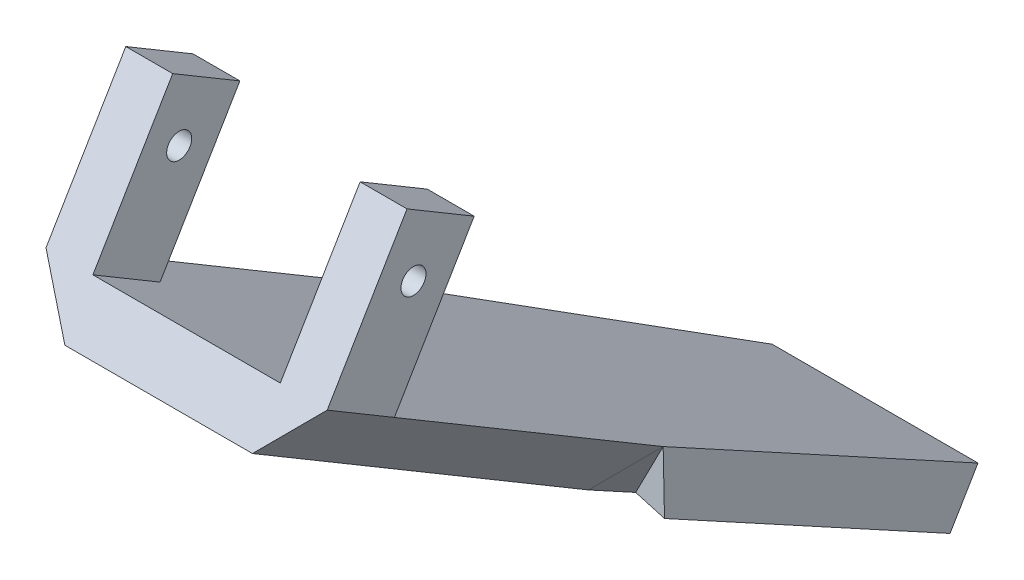
ISO-10303-21;
HEADER;
FILE_DESCRIPTION(('STEP AP214'),'2;1');
FILE_NAME('part.step','',(''),(''),'','','');
FILE_SCHEMA(('AUTOMOTIVE_DESIGN { 1 0 10303 214 1 1 1 1 }'));
ENDSEC;
DATA;
#1=APPLICATION_CONTEXT('core data for automotive mechanical design processes');
#2=APPLICATION_PROTOCOL_DEFINITION('international standard','automotive_design',2000,#1);
#3=PRODUCT_CONTEXT('',#1,'mechanical');
#4=PRODUCT('Part','Part','',(#3));
#5=PRODUCT_RELATED_PRODUCT_CATEGORY('part','',(#4));
#6=PRODUCT_DEFINITION_FORMATION('','',#4);
#7=PRODUCT_DEFINITION_CONTEXT('part definition',#1,'design');
#8=PRODUCT_DEFINITION('design','',#6,#7);
#9=PRODUCT_DEFINITION_SHAPE('','',#8);
#10=(LENGTH_UNIT() NAMED_UNIT(*) SI_UNIT(.MILLI.,.METRE.));
#11=(NAMED_UNIT(*) PLANE_ANGLE_UNIT() SI_UNIT($,.RADIAN.));
#12=(NAMED_UNIT(*) SI_UNIT($,.STERADIAN.) SOLID_ANGLE_UNIT());
#13=UNCERTAINTY_MEASURE_WITH_UNIT(LENGTH_MEASURE(1.E-05),#10,'distance_accuracy_value','');
#14=(GEOMETRIC_REPRESENTATION_CONTEXT(3) GLOBAL_UNCERTAINTY_ASSIGNED_CONTEXT((#13)) GLOBAL_UNIT_ASSIGNED_CONTEXT((#10,
#11,#12)) REPRESENTATION_CONTEXT('',''));
#15=CARTESIAN_POINT('',(0.,0.,0.));
#16=DIRECTION('',(0.,0.,1.));
#17=DIRECTION('',(1.,0.,0.));
#18=AXIS2_PLACEMENT_3D('',#15,#16,#17);
#19=CARTESIAN_POINT('',(3.15077540342877E-13,107.565160262146,-63.8830981525143));
#20=DIRECTION('',(0.,0.859797597686012,-0.510634988042694));
#21=DIRECTION('',(0.,0.510634988042694,0.859797597686012));
#22=AXIS2_PLACEMENT_3D('',#19,#20,#21);
#23=PLANE('',#22);
#24=DIRECTION('',(1.,0.,0.));
#25=VECTOR('',#24,1.);
#26=CARTESIAN_POINT('',(-22.8498957354244,169.178242790574,39.8598524569394));
#27=LINE('',#26,#25);
#28=CARTESIAN_POINT('',(-22.8498957354244,169.178242790574,39.8598524569394));
#29=VERTEX_POINT('',#28);
#30=CARTESIAN_POINT('',(-15.2298957354244,169.178242790574,39.8598524569394));
#31=VERTEX_POINT('',#30);
#32=EDGE_CURVE('E175',#29,#31,#27,.T.);
#33=ORIENTED_EDGE('',*,*,#32,.T.);
#34=DIRECTION('',(0.,-0.510634988042694,-0.859797597686012));
#35=VECTOR('',#34,1.);
#36=CARTESIAN_POINT('',(-15.2298957354245,175.663307138716,50.7792819475518));
#37=LINE('',#36,#35);
#38=CARTESIAN_POINT('',(-15.2298957354245,175.663307138716,50.7792819475518));
#39=VERTEX_POINT('',#38);
#40=EDGE_CURVE('E164',#39,#31,#37,.T.);
#41=ORIENTED_EDGE('',*,*,#40,.F.);
#42=DIRECTION('',(-1.,0.,0.));
#43=VECTOR('',#42,1.);
#44=CARTESIAN_POINT('',(22.8498957354245,175.663307138716,50.7792819475517));
#45=LINE('',#44,#43);
#46=CARTESIAN_POINT('',(15.2298957354244,175.663307138716,50.7792819475517));
#47=VERTEX_POINT('',#46);
#48=EDGE_CURVE('E202',#47,#39,#45,.T.);
#49=ORIENTED_EDGE('',*,*,#48,.F.);
#50=DIRECTION('',(0.,-0.510634988042694,-0.859797597686012));
#51=VECTOR('',#50,1.);
#52=CARTESIAN_POINT('',(15.2298957354245,175.663307138716,50.7792819475518));
#53=LINE('',#52,#51);
#54=CARTESIAN_POINT('',(15.2298957354244,169.178242790574,39.8598524569394));
#55=VERTEX_POINT('',#54);
#56=EDGE_CURVE('E50',#47,#55,#53,.T.);
#57=ORIENTED_EDGE('',*,*,#56,.T.);
#58=DIRECTION('',(-1.,0.,0.));
#59=VECTOR('',#58,1.);
#60=CARTESIAN_POINT('',(22.8498957354244,169.178242790574,39.8598524569394));
#61=LINE('',#60,#59);
#62=CARTESIAN_POINT('',(22.8498957354244,169.178242790574,39.8598524569394));
#63=VERTEX_POINT('',#62);
#64=EDGE_CURVE('E189',#63,#55,#61,.T.);
#65=ORIENTED_EDGE('',*,*,#64,.F.);
#66=DIRECTION('',(0.,-0.510634988042694,-0.859797597686012));
#67=VECTOR('',#66,1.);
#68=CARTESIAN_POINT('',(22.8498957354245,175.663307138716,50.7792819475517));
#69=LINE('',#68,#67);
#70=CARTESIAN_POINT('',(22.8498957354242,143.237985398005,-3.81786550551013));
#71=VERTEX_POINT('',#70);
#72=EDGE_CURVE('E216',#63,#71,#69,.T.);
#73=ORIENTED_EDGE('',*,*,#72,.T.);
#74=DIRECTION('',(0.0915092330061505,0.508492479999174,0.856190082901523));
#75=VECTOR('',#74,1.);
#76=CARTESIAN_POINT('',(22.8498957354257,143.237985398005,-3.81786550551011));
#77=LINE('',#76,#75);
#78=CARTESIAN_POINT('',(16.726681449711,109.212911474588,-61.1086456233753));
#79=VERTEX_POINT('',#78);
#80=EDGE_CURVE('E260',#79,#71,#77,.T.);
#81=ORIENTED_EDGE('',*,*,#80,.F.);
#82=DIRECTION('',(1.,0.,0.));
#83=VECTOR('',#82,1.);
#84=CARTESIAN_POINT('',(16.726681449711,109.212911474588,-61.1086456233753));
#85=LINE('',#84,#83);
#86=CARTESIAN_POINT('',(-16.7266814497103,109.212911474588,-61.1086456233752));
#87=VERTEX_POINT('',#86);
#88=EDGE_CURVE('E248',#87,#79,#85,.T.);
#89=ORIENTED_EDGE('',*,*,#88,.F.);
#90=DIRECTION('',(0.0915092330061379,-0.508492479999174,-0.856190082901523));
#91=VECTOR('',#90,1.);
#92=CARTESIAN_POINT('',(-16.7266814497103,109.212911474588,-61.1086456233752));
#93=LINE('',#92,#91);
#94=CARTESIAN_POINT('',(-22.8498957354242,143.237985398005,-3.81786550550991));
#95=VERTEX_POINT('',#94);
#96=EDGE_CURVE('E253',#95,#87,#93,.T.);
#97=ORIENTED_EDGE('',*,*,#96,.F.);
#98=DIRECTION('',(0.,-0.510634988042694,-0.859797597686012));
#99=VECTOR('',#98,1.);
#100=CARTESIAN_POINT('',(-22.8498957354238,175.663307138716,50.7792819475519));
#101=LINE('',#100,#99);
#102=EDGE_CURVE('E223',#29,#95,#101,.T.);
#103=ORIENTED_EDGE('',*,*,#102,.F.);
#104=EDGE_LOOP('',(#33,#41,#49,#57,#65,#73,#81,#89,#97,#103));
#105=FACE_BOUND('',#104,.T.);
#106=ADVANCED_FACE('F35',(#105),#23,.T.);
#107=CARTESIAN_POINT('',(-16.7266814497103,101.56931083116,-56.5691005796756));
#108=DIRECTION('',(0.995804227885496,0.0467278161018831,0.0786794187047682));
#109=DIRECTION('',(0.0787654574435743,0.,-0.996893175176611));
#110=AXIS2_PLACEMENT_3D('',#107,#108,#109);
#111=PLANE('',#110);
#112=DIRECTION('',(0.052479328962753,-0.995972651507853,-0.0726938613641871));
#113=VECTOR('',#112,1.);
#114=CARTESIAN_POINT('',(-20.4538526052089,97.7649681797145,-7.13684138750147));
#115=LINE('',#114,#113);
#116=CARTESIAN_POINT('',(-22.2803977258976,132.429835717221,-4.60672866687167));
#117=VERTEX_POINT('',#116);
#118=EDGE_CURVE('E246',#95,#117,#115,.T.);
#119=ORIENTED_EDGE('',*,*,#118,.F.);
#120=ORIENTED_EDGE('',*,*,#96,.T.);
#121=DIRECTION('',(0.,0.859797597686012,-0.510634988042694));
#122=VECTOR('',#121,1.);
#123=CARTESIAN_POINT('',(-16.7266814497103,101.56931083116,-56.5691005796756));
#124=LINE('',#123,#122);
#125=CARTESIAN_POINT('',(-16.7266814497103,101.56931083116,-56.5691005796756));
#126=VERTEX_POINT('',#125);
#127=EDGE_CURVE('E43',#126,#87,#124,.T.);
#128=ORIENTED_EDGE('',*,*,#127,.F.);
#129=DIRECTION('',(0.0915092330061379,-0.508492479999174,-0.856190082901523));
#130=VECTOR('',#129,1.);
#131=CARTESIAN_POINT('',(-16.7266814497103,101.56931083116,-56.5691005796756));
#132=LINE('',#131,#130);
#133=EDGE_CURVE('E256',#117,#126,#132,.T.);
#134=ORIENTED_EDGE('',*,*,#133,.F.);
#135=EDGE_LOOP('',(#119,#120,#128,#134));
#136=FACE_BOUND('',#135,.T.);
#137=ADVANCED_FACE('F284',(#136),#111,.F.);
#138=CARTESIAN_POINT('',(2.92136663140291E-13,99.9215596187176,-59.3435531088147));
#139=DIRECTION('',(0.,0.859797597686012,-0.510634988042694));
#140=DIRECTION('',(0.,0.510634988042694,0.859797597686012));
#141=AXIS2_PLACEMENT_3D('',#138,#139,#140);
#142=PLANE('',#141);
#143=DIRECTION('',(0.0915092330061505,0.508492479999174,0.856190082901523));
#144=VECTOR('',#143,1.);
#145=CARTESIAN_POINT('',(22.8498957354256,135.594384754576,0.721679538189439));
#146=LINE('',#145,#144);
#147=CARTESIAN_POINT('',(16.7266814497109,101.56931083116,-56.5691005796757));
#148=VERTEX_POINT('',#147);
#149=CARTESIAN_POINT('',(22.2803977258991,132.429835717221,-4.60672866687108));
#150=VERTEX_POINT('',#149);
#151=EDGE_CURVE('E252',#148,#150,#146,.T.);
#152=ORIENTED_EDGE('',*,*,#151,.T.);
#153=DIRECTION('',(-0.902018907578412,-0.220439350280052,-0.371171635795567));
#154=VECTOR('',#153,1.);
#155=CARTESIAN_POINT('',(-20.6378422511927,121.941287355067,-22.2671493120769));
#156=LINE('',#155,#154);
#157=CARTESIAN_POINT('',(14.320423419229,130.484542165538,-7.88217739579986));
#158=VERTEX_POINT('',#157);
#159=EDGE_CURVE('E58',#150,#158,#156,.T.);
#160=ORIENTED_EDGE('',*,*,#159,.T.);
#161=DIRECTION('',(-0.0915092330061375,-0.508492479999174,-0.856190082901524));
#162=VECTOR('',#161,1.);
#163=CARTESIAN_POINT('',(8.74639313406406,99.5111377320872,-60.0346137694154));
#164=LINE('',#163,#162);
#165=CARTESIAN_POINT('',(15.2399999999991,135.594384754576,0.721679538189475));
#166=VERTEX_POINT('',#165);
#167=EDGE_CURVE('E227',#166,#158,#164,.T.);
#168=ORIENTED_EDGE('',*,*,#167,.F.);
#169=DIRECTION('',(0.,-0.510634988042694,-0.859797597686012));
#170=VECTOR('',#169,1.);
#171=CARTESIAN_POINT('',(15.2399999999995,168.019706495288,55.3188269912513));
#172=LINE('',#171,#170);
#173=CARTESIAN_POINT('',(15.2399999999995,168.019706495288,55.3188269912513));
#174=VERTEX_POINT('',#173);
#175=EDGE_CURVE('E219',#174,#166,#172,.T.);
#176=ORIENTED_EDGE('',*,*,#175,.F.);
#177=DIRECTION('',(1.,0.,0.));
#178=VECTOR('',#177,1.);
#179=CARTESIAN_POINT('',(-15.2399999999988,168.019706495288,55.3188269912514));
#180=LINE('',#179,#178);
#181=CARTESIAN_POINT('',(-15.2399999999988,168.019706495288,55.3188269912514));
#182=VERTEX_POINT('',#181);
#183=EDGE_CURVE('E212',#182,#174,#180,.T.);
#184=ORIENTED_EDGE('',*,*,#183,.F.);
#185=DIRECTION('',(0.,-0.510634988042694,-0.859797597686012));
#186=VECTOR('',#185,1.);
#187=CARTESIAN_POINT('',(-15.2399999999988,168.019706495288,55.3188269912514));
#188=LINE('',#187,#186);
#189=CARTESIAN_POINT('',(-15.2399999999992,135.594384754577,0.721679538189614));
#190=VERTEX_POINT('',#189);
#191=EDGE_CURVE('E221',#182,#190,#188,.T.);
#192=ORIENTED_EDGE('',*,*,#191,.T.);
#193=DIRECTION('',(-0.0915092330061378,0.508492479999174,0.856190082901523));
#194=VECTOR('',#193,1.);
#195=CARTESIAN_POINT('',(-8.7463931340641,99.5111377320872,-60.0346137694155));
#196=LINE('',#195,#194);
#197=CARTESIAN_POINT('',(-14.320423419229,130.484542165538,-7.88217739579983));
#198=VERTEX_POINT('',#197);
#199=EDGE_CURVE('E237',#198,#190,#196,.T.);
#200=ORIENTED_EDGE('',*,*,#199,.F.);
#201=DIRECTION('',(0.902018907578411,-0.220439350280057,-0.371171635795566));
#202=VECTOR('',#201,1.);
#203=CARTESIAN_POINT('',(20.6378422511932,121.941287355067,-22.2671493120772));
#204=LINE('',#203,#202);
#205=EDGE_CURVE('E243',#117,#198,#204,.T.);
#206=ORIENTED_EDGE('',*,*,#205,.F.);
#207=ORIENTED_EDGE('',*,*,#133,.T.);
#208=DIRECTION('',(1.,0.,0.));
#209=VECTOR('',#208,1.);
#210=CARTESIAN_POINT('',(16.7266814497109,101.56931083116,-56.5691005796757));
#211=LINE('',#210,#209);
#212=EDGE_CURVE('E249',#126,#148,#211,.T.);
#213=ORIENTED_EDGE('',*,*,#212,.T.);
#214=EDGE_LOOP('',(#152,#160,#168,#176,#184,#192,#200,#206,#207,#213));
#215=FACE_BOUND('',#214,.T.);
#216=ADVANCED_FACE('F280',(#215),#142,.F.);
#217=CARTESIAN_POINT('',(16.7266814497109,101.56931083116,-56.5691005796757));
#218=DIRECTION('',(0.,0.510634988042694,0.859797597686012));
#219=DIRECTION('',(0.,-0.859797597686012,0.510634988042694));
#220=AXIS2_PLACEMENT_3D('',#217,#218,#219);
#221=PLANE('',#220);
#222=ORIENTED_EDGE('',*,*,#88,.T.);
#223=DIRECTION('',(0.,0.859797597686012,-0.510634988042694));
#224=VECTOR('',#223,1.);
#225=CARTESIAN_POINT('',(16.7266814497109,101.56931083116,-56.5691005796757));
#226=LINE('',#225,#224);
#227=EDGE_CURVE('E11',#148,#79,#226,.T.);
#228=ORIENTED_EDGE('',*,*,#227,.F.);
#229=ORIENTED_EDGE('',*,*,#212,.F.);
#230=ORIENTED_EDGE('',*,*,#127,.T.);
#231=EDGE_LOOP('',(#222,#228,#229,#230));
#232=FACE_BOUND('',#231,.T.);
#233=ADVANCED_FACE('F37',(#232),#221,.F.);
#234=CARTESIAN_POINT('',(22.8498957354256,135.594384754576,0.721679538189439));
#235=DIRECTION('',(-0.995804227885495,0.046727816101894,0.0786794187047764));
#236=DIRECTION('',(0.0787654574435826,0.,0.99689317517661));
#237=AXIS2_PLACEMENT_3D('',#234,#235,#236);
#238=PLANE('',#237);
#239=ORIENTED_EDGE('',*,*,#80,.T.);
#240=DIRECTION('',(-0.0524793289627648,-0.995972651507852,-0.0726938613641918));
#241=VECTOR('',#240,1.);
#242=CARTESIAN_POINT('',(22.4676982214255,135.984495710882,-4.34728182324054));
#243=LINE('',#242,#241);
#244=EDGE_CURVE('E232',#71,#150,#243,.T.);
#245=ORIENTED_EDGE('',*,*,#244,.T.);
#246=ORIENTED_EDGE('',*,*,#151,.F.);
#247=ORIENTED_EDGE('',*,*,#227,.T.);
#248=EDGE_LOOP('',(#239,#245,#246,#247));
#249=FACE_BOUND('',#248,.T.);
#250=ADVANCED_FACE('F278',(#249),#238,.F.);
#251=CARTESIAN_POINT('',(-30.5495363149618,137.209807160721,-1.06065639384045));
#252=DIRECTION('',(0.369989021228379,-0.0482216174266743,0.927783810908135));
#253=DIRECTION('',(0.928864394965883,0.,-0.370419945149642));
#254=AXIS2_PLACEMENT_3D('',#251,#252,#253);
#255=PLANE('',#254);
#256=ORIENTED_EDGE('',*,*,#118,.T.);
#257=ORIENTED_EDGE('',*,*,#205,.T.);
#258=DIRECTION('',(0.537390658944143,-0.80351761614714,-0.256067803951994));
#259=VECTOR('',#258,1.);
#260=CARTESIAN_POINT('',(-22.8498957354242,143.237985398005,-3.81786550550993));
#261=LINE('',#260,#259);
#262=EDGE_CURVE('E235',#95,#198,#261,.T.);
#263=ORIENTED_EDGE('',*,*,#262,.F.);
#264=EDGE_LOOP('',(#256,#257,#263));
#265=FACE_BOUND('',#264,.T.);
#266=ADVANCED_FACE('F287',(#265),#255,.T.);
#267=CARTESIAN_POINT('',(52.0681969952759,40.7650680235233,-18.6454037302863));
#268=DIRECTION('',(-0.757838639718275,-0.59332462965393,0.271378849573768));
#269=DIRECTION('',(0.61645871798258,-0.787387229400677,0.));
#270=AXIS2_PLACEMENT_3D('',#267,#268,#269);
#271=PLANE('',#270);
#272=DIRECTION('',(-0.65029348212864,0.653173690051668,-0.387920762173535));
#273=VECTOR('',#272,1.);
#274=CARTESIAN_POINT('',(-18.4580849825889,138.826722923025,-1.19801059171771));
#275=LINE('',#274,#273);
#276=EDGE_CURVE('E240',#190,#95,#275,.T.);
#277=ORIENTED_EDGE('',*,*,#276,.T.);
#278=ORIENTED_EDGE('',*,*,#262,.T.);
#279=ORIENTED_EDGE('',*,*,#199,.T.);
#280=EDGE_LOOP('',(#277,#278,#279));
#281=FACE_BOUND('',#280,.T.);
#282=ADVANCED_FACE('F289',(#281),#271,.T.);
#283=CARTESIAN_POINT('',(30.5495363149618,137.209807160721,-1.06065639384045));
#284=DIRECTION('',(0.369989021228379,0.0482216174266743,-0.927783810908135));
#285=DIRECTION('',(-0.928864394965883,0.,-0.370419945149642));
#286=AXIS2_PLACEMENT_3D('',#283,#284,#285);
#287=PLANE('',#286);
#288=ORIENTED_EDGE('',*,*,#244,.F.);
#289=DIRECTION('',(-0.537390658944143,-0.80351761614714,-0.256067803951993));
#290=VECTOR('',#289,1.);
#291=CARTESIAN_POINT('',(22.8498957354242,143.237985398005,-3.81786550550993));
#292=LINE('',#291,#290);
#293=EDGE_CURVE('E225',#71,#158,#292,.T.);
#294=ORIENTED_EDGE('',*,*,#293,.T.);
#295=ORIENTED_EDGE('',*,*,#159,.F.);
#296=EDGE_LOOP('',(#288,#294,#295));
#297=FACE_BOUND('',#296,.T.);
#298=ADVANCED_FACE('F444',(#297),#287,.F.);
#299=CARTESIAN_POINT('',(-52.0681969952759,40.7650680235233,-18.6454037302863));
#300=DIRECTION('',(0.757838639718275,-0.59332462965393,0.271378849573768));
#301=DIRECTION('',(-0.61645871798258,-0.787387229400677,0.));
#302=AXIS2_PLACEMENT_3D('',#299,#300,#301);
#303=PLANE('',#302);
#304=DIRECTION('',(-0.65029348212864,-0.653173690051664,0.387920762173541));
#305=VECTOR('',#304,1.);
#306=CARTESIAN_POINT('',(-0.867516543751043,119.41552658117,10.3303258895586));
#307=LINE('',#306,#305);
#308=EDGE_CURVE('E229',#71,#166,#307,.T.);
#309=ORIENTED_EDGE('',*,*,#308,.T.);
#310=ORIENTED_EDGE('',*,*,#167,.T.);
#311=ORIENTED_EDGE('',*,*,#293,.F.);
#312=EDGE_LOOP('',(#309,#310,#311));
#313=FACE_BOUND('',#312,.T.);
#314=ADVANCED_FACE('F360',(#313),#303,.T.);
#315=CARTESIAN_POINT('',(-22.8498957354238,175.663307138716,50.7792819475519));
#316=DIRECTION('',(0.759683083332128,0.559120773725074,-0.332062604471003));
#317=DIRECTION('',(-0.592755279599119,0.805382628635216,0.));
#318=AXIS2_PLACEMENT_3D('',#315,#316,#317);
#319=PLANE('',#318);
#320=ORIENTED_EDGE('',*,*,#276,.F.);
#321=ORIENTED_EDGE('',*,*,#191,.F.);
#322=DIRECTION('',(0.65029348212864,-0.653173690051668,0.387920762173534));
#323=VECTOR('',#322,1.);
#324=CARTESIAN_POINT('',(-22.8498957354238,175.663307138716,50.7792819475519));
#325=LINE('',#324,#323);
#326=CARTESIAN_POINT('',(-22.8498957354238,175.663307138716,50.7792819475519));
#327=VERTEX_POINT('',#326);
#328=EDGE_CURVE('E210',#327,#182,#325,.T.);
#329=ORIENTED_EDGE('',*,*,#328,.F.);
#330=EDGE_CURVE('E150',#327,#29,#101,.T.);
#331=ORIENTED_EDGE('',*,*,#330,.T.);
#332=ORIENTED_EDGE('',*,*,#102,.T.);
#333=EDGE_LOOP('',(#320,#321,#329,#331,#332));
#334=FACE_BOUND('',#333,.T.);
#335=ADVANCED_FACE('F293',(#334),#319,.F.);
#336=CARTESIAN_POINT('',(15.2399999999995,168.019706495288,55.3188269912513));
#337=DIRECTION('',(-0.759683083332125,0.559120773725081,-0.332062604470998));
#338=DIRECTION('',(-0.592755279599125,-0.805382628635211,0.));
#339=AXIS2_PLACEMENT_3D('',#336,#337,#338);
#340=PLANE('',#339);
#341=ORIENTED_EDGE('',*,*,#308,.F.);
#342=ORIENTED_EDGE('',*,*,#72,.F.);
#343=CARTESIAN_POINT('',(22.8498957354245,175.663307138716,50.7792819475517));
#344=VERTEX_POINT('',#343);
#345=EDGE_CURVE('E217',#344,#63,#69,.T.);
#346=ORIENTED_EDGE('',*,*,#345,.F.);
#347=DIRECTION('',(0.650293482128643,0.653173690051662,-0.387920762173539));
#348=VECTOR('',#347,1.);
#349=CARTESIAN_POINT('',(15.2399999999995,168.019706495288,55.3188269912513));
#350=LINE('',#349,#348);
#351=EDGE_CURVE('E214',#174,#344,#350,.T.);
#352=ORIENTED_EDGE('',*,*,#351,.F.);
#353=ORIENTED_EDGE('',*,*,#175,.T.);
#354=EDGE_LOOP('',(#341,#342,#346,#352,#353));
#355=FACE_BOUND('',#354,.T.);
#356=ADVANCED_FACE('F370',(#355),#340,.F.);
#357=CARTESIAN_POINT('',(7.8663034480051E-13,68.0981468765698,114.662380100066));
#358=DIRECTION('',(0.,0.510634988042693,0.859797597686013));
#359=DIRECTION('',(0.,-0.859797597686013,0.510634988042693));
#360=AXIS2_PLACEMENT_3D('',#357,#358,#359);
#361=PLANE('',#360);
#362=ORIENTED_EDGE('',*,*,#351,.T.);
#363=DIRECTION('',(0.,-0.859797597686012,0.510634988042694));
#364=VECTOR('',#363,1.);
#365=CARTESIAN_POINT('',(22.8498957354246,197.502166119941,37.8091532512673));
#366=LINE('',#365,#364);
#367=CARTESIAN_POINT('',(22.8498957354246,197.502166119941,37.8091532512673));
#368=VERTEX_POINT('',#367);
#369=EDGE_CURVE('E200',#368,#344,#366,.T.);
#370=ORIENTED_EDGE('',*,*,#369,.F.);
#371=DIRECTION('',(-1.,0.,0.));
#372=VECTOR('',#371,1.);
#373=CARTESIAN_POINT('',(22.8498957354246,197.502166119941,37.8091532512673));
#374=LINE('',#373,#372);
#375=CARTESIAN_POINT('',(15.2298957354246,197.502166119941,37.8091532512673));
#376=VERTEX_POINT('',#375);
#377=EDGE_CURVE('E185',#368,#376,#374,.T.);
#378=ORIENTED_EDGE('',*,*,#377,.T.);
#379=DIRECTION('',(0.,-0.859797597686012,0.510634988042694));
#380=VECTOR('',#379,1.);
#381=CARTESIAN_POINT('',(15.2298957354246,197.502166119941,37.8091532512673));
#382=LINE('',#381,#380);
#383=EDGE_CURVE('E196',#376,#47,#382,.T.);
#384=ORIENTED_EDGE('',*,*,#383,.T.);
#385=ORIENTED_EDGE('',*,*,#48,.T.);
#386=DIRECTION('',(0.,-0.859797597686012,0.510634988042694));
#387=VECTOR('',#386,1.);
#388=CARTESIAN_POINT('',(-15.2298957354246,197.502166119941,37.8091532512673));
#389=LINE('',#388,#387);
#390=CARTESIAN_POINT('',(-15.2298957354246,197.502166119941,37.8091532512673));
#391=VERTEX_POINT('',#390);
#392=EDGE_CURVE('E162',#391,#39,#389,.T.);
#393=ORIENTED_EDGE('',*,*,#392,.F.);
#394=DIRECTION('',(1.,0.,0.));
#395=VECTOR('',#394,1.);
#396=CARTESIAN_POINT('',(-22.8498957354246,197.502166119941,37.8091532512673));
#397=LINE('',#396,#395);
#398=CARTESIAN_POINT('',(-22.8498957354246,197.502166119941,37.8091532512673));
#399=VERTEX_POINT('',#398);
#400=EDGE_CURVE('E158',#399,#391,#397,.T.);
#401=ORIENTED_EDGE('',*,*,#400,.F.);
#402=DIRECTION('',(0.,-0.859797597686012,0.510634988042694));
#403=VECTOR('',#402,1.);
#404=CARTESIAN_POINT('',(-22.8498957354246,197.502166119941,37.8091532512673));
#405=LINE('',#404,#403);
#406=EDGE_CURVE('E144',#399,#327,#405,.T.);
#407=ORIENTED_EDGE('',*,*,#406,.T.);
#408=ORIENTED_EDGE('',*,*,#328,.T.);
#409=ORIENTED_EDGE('',*,*,#183,.T.);
#410=EDGE_LOOP('',(#362,#370,#378,#384,#385,#393,#401,#407,#408,#409));
#411=FACE_BOUND('',#410,.T.);
#412=ADVANCED_FACE('F160',(#411),#361,.T.);
#413=CARTESIAN_POINT('',(22.8498957354246,197.502166119941,37.8091532512673));
#414=DIRECTION('',(-1.,0.,0.));
#415=DIRECTION('',(0.,-1.,0.));
#416=AXIS2_PLACEMENT_3D('',#413,#414,#415);
#417=PLANE('',#416);
#418=CARTESIAN_POINT('',(22.8498957354257,186.834421892253,36.7592822626979));
#419=DIRECTION('',(-1.,0.,0.));
#420=DIRECTION('',(0.,-1.,0.));
#421=AXIS2_PLACEMENT_3D('',#418,#419,#420);
#422=CIRCLE('',#421,2.03199999668591);
#423=CARTESIAN_POINT('',(22.8498957354257,184.802421895568,36.7592822626979));
#424=VERTEX_POINT('',#423);
#425=EDGE_CURVE('E477',#424,#424,#422,.T.);
#426=ORIENTED_EDGE('',*,*,#425,.T.);
#427=EDGE_LOOP('',(#426));
#428=FACE_BOUND('',#427,.T.);
#429=ORIENTED_EDGE('',*,*,#345,.T.);
#430=DIRECTION('',(0.,-0.859797597686012,0.510634988042694));
#431=VECTOR('',#430,1.);
#432=CARTESIAN_POINT('',(22.8498957354245,191.017101771799,26.8897237606549));
#433=LINE('',#432,#431);
#434=CARTESIAN_POINT('',(22.8498957354245,191.017101771799,26.8897237606549));
#435=VERTEX_POINT('',#434);
#436=EDGE_CURVE('E203',#435,#63,#433,.T.);
#437=ORIENTED_EDGE('',*,*,#436,.F.);
#438=DIRECTION('',(0.,-0.510634988042694,-0.859797597686012));
#439=VECTOR('',#438,1.);
#440=CARTESIAN_POINT('',(22.8498957354246,197.502166119941,37.8091532512673));
#441=LINE('',#440,#439);
#442=EDGE_CURVE('E194',#368,#435,#441,.T.);
#443=ORIENTED_EDGE('',*,*,#442,.F.);
#444=ORIENTED_EDGE('',*,*,#369,.T.);
#445=EDGE_LOOP('',(#429,#437,#443,#444));
#446=FACE_BOUND('',#445,.T.);
#447=ADVANCED_FACE('F387',(#428,#446),#417,.F.);
#448=CARTESIAN_POINT('',(22.8498957354245,191.017101771799,26.8897237606549));
#449=DIRECTION('',(0.,0.510634988042694,0.859797597686012));
#450=DIRECTION('',(0.,-0.859797597686012,0.510634988042694));
#451=AXIS2_PLACEMENT_3D('',#448,#449,#450);
#452=PLANE('',#451);
#453=ORIENTED_EDGE('',*,*,#64,.T.);
#454=DIRECTION('',(0.,-0.859797597686012,0.510634988042694));
#455=VECTOR('',#454,1.);
#456=CARTESIAN_POINT('',(15.2298957354245,191.017101771799,26.889723760655));
#457=LINE('',#456,#455);
#458=CARTESIAN_POINT('',(15.2298957354245,191.017101771799,26.889723760655));
#459=VERTEX_POINT('',#458);
#460=EDGE_CURVE('E206',#459,#55,#457,.T.);
#461=ORIENTED_EDGE('',*,*,#460,.F.);
#462=DIRECTION('',(-1.,0.,0.));
#463=VECTOR('',#462,1.);
#464=CARTESIAN_POINT('',(22.8498957354245,191.017101771799,26.8897237606549));
#465=LINE('',#464,#463);
#466=EDGE_CURVE('E192',#435,#459,#465,.T.);
#467=ORIENTED_EDGE('',*,*,#466,.F.);
#468=ORIENTED_EDGE('',*,*,#436,.T.);
#469=EDGE_LOOP('',(#453,#461,#467,#468));
#470=FACE_BOUND('',#469,.T.);
#471=ADVANCED_FACE('F402',(#470),#452,.F.);
#472=CARTESIAN_POINT('',(15.2298957354246,197.502166119941,37.8091532512673));
#473=DIRECTION('',(-1.,0.,0.));
#474=DIRECTION('',(0.,-1.,0.));
#475=AXIS2_PLACEMENT_3D('',#472,#473,#474);
#476=PLANE('',#475);
#477=CARTESIAN_POINT('',(15.2298957354245,186.834421892253,36.7592822626979));
#478=DIRECTION('',(-1.,0.,0.));
#479=DIRECTION('',(0.,-1.,0.));
#480=AXIS2_PLACEMENT_3D('',#477,#478,#479);
#481=CIRCLE('',#480,2.03199999668591);
#482=CARTESIAN_POINT('',(15.2298957354245,184.802421895568,36.7592822626979));
#483=VERTEX_POINT('',#482);
#484=EDGE_CURVE('E178',#483,#483,#481,.T.);
#485=ORIENTED_EDGE('',*,*,#484,.F.);
#486=EDGE_LOOP('',(#485));
#487=FACE_BOUND('',#486,.T.);
#488=ORIENTED_EDGE('',*,*,#56,.F.);
#489=ORIENTED_EDGE('',*,*,#383,.F.);
#490=DIRECTION('',(0.,-0.510634988042694,-0.859797597686012));
#491=VECTOR('',#490,1.);
#492=CARTESIAN_POINT('',(15.2298957354246,197.502166119941,37.8091532512673));
#493=LINE('',#492,#491);
#494=EDGE_CURVE('E188',#376,#459,#493,.T.);
#495=ORIENTED_EDGE('',*,*,#494,.T.);
#496=ORIENTED_EDGE('',*,*,#460,.T.);
#497=EDGE_LOOP('',(#488,#489,#495,#496));
#498=FACE_BOUND('',#497,.T.);
#499=ADVANCED_FACE('F312',(#487,#498),#476,.T.);
#500=CARTESIAN_POINT('',(3.82190589881541E-13,129.404019243371,-76.8532268487988));
#501=DIRECTION('',(0.,-0.859797597686012,0.510634988042694));
#502=DIRECTION('',(0.,-0.510634988042694,-0.859797597686012));
#503=AXIS2_PLACEMENT_3D('',#500,#501,#502);
#504=PLANE('',#503);
#505=ORIENTED_EDGE('',*,*,#377,.F.);
#506=ORIENTED_EDGE('',*,*,#442,.T.);
#507=ORIENTED_EDGE('',*,*,#466,.T.);
#508=ORIENTED_EDGE('',*,*,#494,.F.);
#509=EDGE_LOOP('',(#505,#506,#507,#508));
#510=FACE_BOUND('',#509,.T.);
#511=ADVANCED_FACE('F304',(#510),#504,.F.);
#512=CARTESIAN_POINT('',(-15.2298957354246,197.502166119941,37.8091532512673));
#513=DIRECTION('',(-1.,0.,0.));
#514=DIRECTION('',(0.,-1.,0.));
#515=AXIS2_PLACEMENT_3D('',#512,#513,#514);
#516=PLANE('',#515);
#517=CARTESIAN_POINT('',(-15.2298957354245,186.834421892253,36.7592822626979));
#518=DIRECTION('',(-1.,0.,0.));
#519=DIRECTION('',(0.,-1.,0.));
#520=AXIS2_PLACEMENT_3D('',#517,#518,#519);
#521=CIRCLE('',#520,2.03199999668591);
#522=CARTESIAN_POINT('',(-15.2298957354245,184.802421895568,36.7592822626979));
#523=VERTEX_POINT('',#522);
#524=EDGE_CURVE('E480',#523,#523,#521,.T.);
#525=ORIENTED_EDGE('',*,*,#524,.T.);
#526=EDGE_LOOP('',(#525));
#527=FACE_BOUND('',#526,.T.);
#528=ORIENTED_EDGE('',*,*,#40,.T.);
#529=DIRECTION('',(0.,-0.859797597686012,0.510634988042694));
#530=VECTOR('',#529,1.);
#531=CARTESIAN_POINT('',(-15.2298957354245,191.017101771799,26.889723760655));
#532=LINE('',#531,#530);
#533=CARTESIAN_POINT('',(-15.2298957354245,191.017101771799,26.889723760655));
#534=VERTEX_POINT('',#533);
#535=EDGE_CURVE('E182',#534,#31,#532,.T.);
#536=ORIENTED_EDGE('',*,*,#535,.F.);
#537=DIRECTION('',(0.,-0.510634988042694,-0.859797597686012));
#538=VECTOR('',#537,1.);
#539=CARTESIAN_POINT('',(-15.2298957354246,197.502166119941,37.8091532512673));
#540=LINE('',#539,#538);
#541=EDGE_CURVE('E154',#391,#534,#540,.T.);
#542=ORIENTED_EDGE('',*,*,#541,.F.);
#543=ORIENTED_EDGE('',*,*,#392,.T.);
#544=EDGE_LOOP('',(#528,#536,#542,#543));
#545=FACE_BOUND('',#544,.T.);
#546=ADVANCED_FACE('F302',(#527,#545),#516,.F.);
#547=CARTESIAN_POINT('',(-22.8498957354245,191.017101771799,26.8897237606549));
#548=DIRECTION('',(0.,-0.510634988042694,-0.859797597686012));
#549=DIRECTION('',(0.,0.859797597686012,-0.510634988042694));
#550=AXIS2_PLACEMENT_3D('',#547,#548,#549);
#551=PLANE('',#550);
#552=ORIENTED_EDGE('',*,*,#32,.F.);
#553=DIRECTION('',(0.,-0.859797597686012,0.510634988042694));
#554=VECTOR('',#553,1.);
#555=CARTESIAN_POINT('',(-22.8498957354245,191.017101771799,26.8897237606549));
#556=LINE('',#555,#554);
#557=CARTESIAN_POINT('',(-22.8498957354245,191.017101771799,26.8897237606549));
#558=VERTEX_POINT('',#557);
#559=EDGE_CURVE('E153',#558,#29,#556,.T.);
#560=ORIENTED_EDGE('',*,*,#559,.F.);
#561=DIRECTION('',(1.,0.,0.));
#562=VECTOR('',#561,1.);
#563=CARTESIAN_POINT('',(-22.8498957354245,191.017101771799,26.8897237606549));
#564=LINE('',#563,#562);
#565=EDGE_CURVE('E169',#558,#534,#564,.T.);
#566=ORIENTED_EDGE('',*,*,#565,.T.);
#567=ORIENTED_EDGE('',*,*,#535,.T.);
#568=EDGE_LOOP('',(#552,#560,#566,#567));
#569=FACE_BOUND('',#568,.T.);
#570=ADVANCED_FACE('F299',(#569),#551,.T.);
#571=CARTESIAN_POINT('',(-22.8498957354246,197.502166119941,37.8091532512673));
#572=DIRECTION('',(-1.,0.,0.));
#573=DIRECTION('',(0.,-1.,0.));
#574=AXIS2_PLACEMENT_3D('',#571,#572,#573);
#575=PLANE('',#574);
#576=CARTESIAN_POINT('',(-22.8498957354231,186.834421892253,36.7592822626979));
#577=DIRECTION('',(-1.,0.,0.));
#578=DIRECTION('',(0.,-1.,0.));
#579=AXIS2_PLACEMENT_3D('',#576,#577,#578);
#580=CIRCLE('',#579,2.03199999668591);
#581=CARTESIAN_POINT('',(-22.8498957354231,184.802421895568,36.7592822626979));
#582=VERTEX_POINT('',#581);
#583=EDGE_CURVE('E475',#582,#582,#580,.T.);
#584=ORIENTED_EDGE('',*,*,#583,.F.);
#585=EDGE_LOOP('',(#584));
#586=FACE_BOUND('',#585,.T.);
#587=ORIENTED_EDGE('',*,*,#330,.F.);
#588=ORIENTED_EDGE('',*,*,#406,.F.);
#589=DIRECTION('',(0.,-0.510634988042694,-0.859797597686012));
#590=VECTOR('',#589,1.);
#591=CARTESIAN_POINT('',(-22.8498957354246,197.502166119941,37.8091532512673));
#592=LINE('',#591,#590);
#593=EDGE_CURVE('E148',#399,#558,#592,.T.);
#594=ORIENTED_EDGE('',*,*,#593,.T.);
#595=ORIENTED_EDGE('',*,*,#559,.T.);
#596=EDGE_LOOP('',(#587,#588,#594,#595));
#597=FACE_BOUND('',#596,.T.);
#598=ADVANCED_FACE('F146',(#586,#597),#575,.T.);
#599=CARTESIAN_POINT('',(-4.0914187631902E-13,129.404019243371,-76.8532268487988));
#600=DIRECTION('',(0.,-0.859797597686012,0.510634988042694));
#601=DIRECTION('',(0.,-0.510634988042694,-0.859797597686012));
#602=AXIS2_PLACEMENT_3D('',#599,#600,#601);
#603=PLANE('',#602);
#604=ORIENTED_EDGE('',*,*,#400,.T.);
#605=ORIENTED_EDGE('',*,*,#541,.T.);
#606=ORIENTED_EDGE('',*,*,#565,.F.);
#607=ORIENTED_EDGE('',*,*,#593,.F.);
#608=EDGE_LOOP('',(#604,#605,#606,#607));
#609=FACE_BOUND('',#608,.T.);
#610=ADVANCED_FACE('F167',(#609),#603,.F.);
#611=CARTESIAN_POINT('',(22.8498957354257,186.834421892253,36.7592822626979));
#612=DIRECTION('',(-1.,0.,0.));
#613=DIRECTION('',(0.,-1.,0.));
#614=AXIS2_PLACEMENT_3D('',#611,#612,#613);
#615=CYLINDRICAL_SURFACE('',#614,2.03199999668591);
#616=ORIENTED_EDGE('',*,*,#583,.T.);
#617=EDGE_LOOP('',(#616));
#618=FACE_BOUND('',#617,.T.);
#619=ORIENTED_EDGE('',*,*,#524,.F.);
#620=EDGE_LOOP('',(#619));
#621=FACE_BOUND('',#620,.T.);
#622=ADVANCED_FACE('F472',(#618,#621),#615,.F.);
#623=ORIENTED_EDGE('',*,*,#484,.T.);
#624=EDGE_LOOP('',(#623));
#625=FACE_BOUND('',#624,.T.);
#626=ORIENTED_EDGE('',*,*,#425,.F.);
#627=EDGE_LOOP('',(#626));
#628=FACE_BOUND('',#627,.T.);
#629=ADVANCED_FACE('F486',(#625,#628),#615,.F.);
#630=CLOSED_SHELL('',(#106,#137,#216,#233,#250,#266,#282,#298,#314,#335,#356,#412,#447,#471,
#499,#511,#546,#570,#598,#610,#622,#629));
#631=MANIFOLD_SOLID_BREP('B2',#630);
#632=ADVANCED_BREP_SHAPE_REPRESENTATION('',(#18,#631),#14);
#633=SHAPE_DEFINITION_REPRESENTATION(#9,#632);
ENDSEC;
END-ISO-10303-21;
